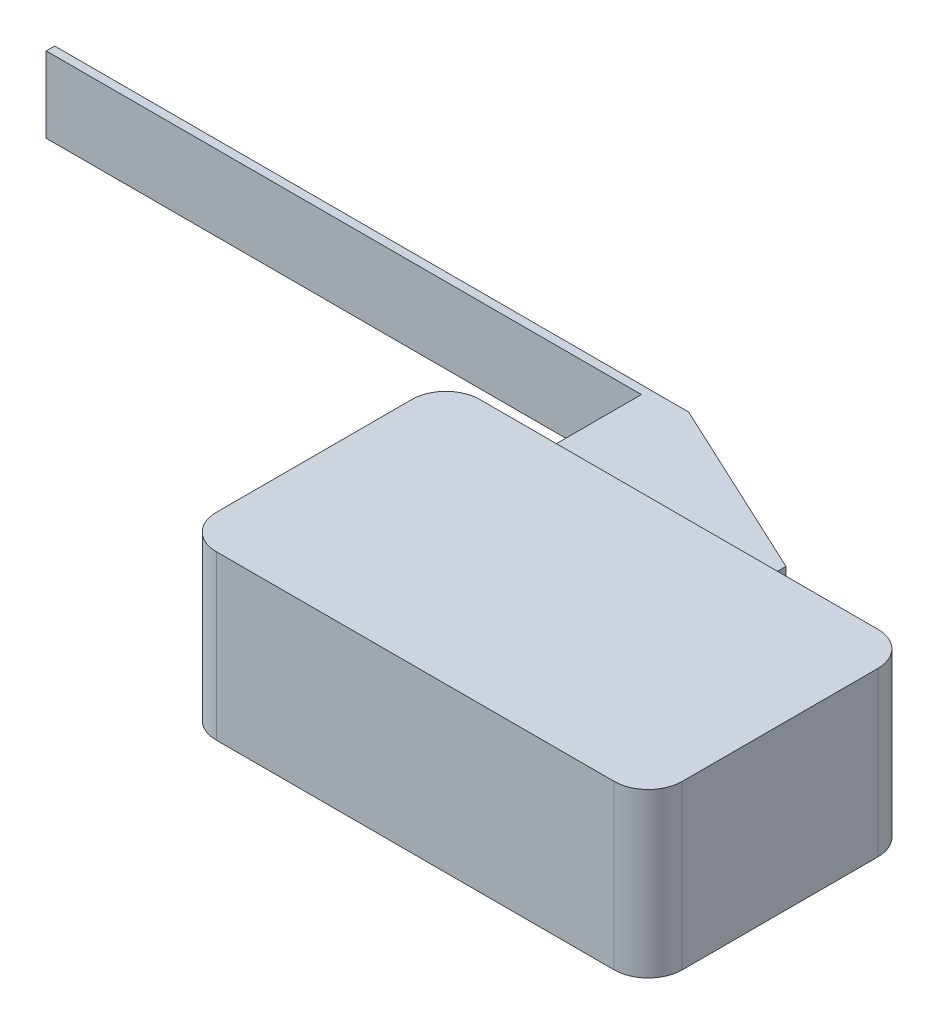
ISO-10303-21;
HEADER;
FILE_DESCRIPTION(('STEP AP214'),'2;1');
FILE_NAME('part.step','',(''),(''),'','','');
FILE_SCHEMA(('AUTOMOTIVE_DESIGN { 1 0 10303 214 1 1 1 1 }'));
ENDSEC;
DATA;
#1=APPLICATION_CONTEXT('core data for automotive mechanical design processes');
#2=APPLICATION_PROTOCOL_DEFINITION('international standard','automotive_design',2000,#1);
#3=PRODUCT_CONTEXT('',#1,'mechanical');
#4=PRODUCT('Part','Part','',(#3));
#5=PRODUCT_RELATED_PRODUCT_CATEGORY('part','',(#4));
#6=PRODUCT_DEFINITION_FORMATION('','',#4);
#7=PRODUCT_DEFINITION_CONTEXT('part definition',#1,'design');
#8=PRODUCT_DEFINITION('design','',#6,#7);
#9=PRODUCT_DEFINITION_SHAPE('','',#8);
#10=(LENGTH_UNIT() NAMED_UNIT(*) SI_UNIT(.MILLI.,.METRE.));
#11=(NAMED_UNIT(*) PLANE_ANGLE_UNIT() SI_UNIT($,.RADIAN.));
#12=(NAMED_UNIT(*) SI_UNIT($,.STERADIAN.) SOLID_ANGLE_UNIT());
#13=UNCERTAINTY_MEASURE_WITH_UNIT(LENGTH_MEASURE(1.E-05),#10,'distance_accuracy_value','');
#14=(GEOMETRIC_REPRESENTATION_CONTEXT(3) GLOBAL_UNCERTAINTY_ASSIGNED_CONTEXT((#13)) GLOBAL_UNIT_ASSIGNED_CONTEXT((#10,
#11,#12)) REPRESENTATION_CONTEXT('',''));
#15=CARTESIAN_POINT('',(0.,0.,0.));
#16=DIRECTION('',(0.,0.,1.));
#17=DIRECTION('',(1.,0.,0.));
#18=AXIS2_PLACEMENT_3D('',#15,#16,#17);
#19=CARTESIAN_POINT('',(4.,2.65,-23.5));
#20=DIRECTION('',(1.,0.,0.));
#21=DIRECTION('',(0.,0.,-1.));
#22=AXIS2_PLACEMENT_3D('',#19,#20,#21);
#23=PLANE('',#22);
#24=DIRECTION('',(0.,1.,0.));
#25=VECTOR('',#24,1.);
#26=CARTESIAN_POINT('',(4.,2.65,-23.));
#27=LINE('',#26,#25);
#28=CARTESIAN_POINT('',(4.,2.65,-23.));
#29=VERTEX_POINT('',#28);
#30=CARTESIAN_POINT('',(4.,7.1,-23.));
#31=VERTEX_POINT('',#30);
#32=EDGE_CURVE('E167',#29,#31,#27,.T.);
#33=ORIENTED_EDGE('',*,*,#32,.F.);
#34=DIRECTION('',(0.,0.,1.));
#35=VECTOR('',#34,1.);
#36=CARTESIAN_POINT('',(4.,2.65,-23.5));
#37=LINE('',#36,#35);
#38=CARTESIAN_POINT('',(4.,2.65,-15.5));
#39=VERTEX_POINT('',#38);
#40=EDGE_CURVE('E151',#29,#39,#37,.T.);
#41=ORIENTED_EDGE('',*,*,#40,.T.);
#42=DIRECTION('',(0.,1.,0.));
#43=VECTOR('',#42,1.);
#44=CARTESIAN_POINT('',(4.,2.65,-15.5));
#45=LINE('',#44,#43);
#46=CARTESIAN_POINT('',(4.,7.1,-15.5));
#47=VERTEX_POINT('',#46);
#48=EDGE_CURVE('E177',#39,#47,#45,.T.);
#49=ORIENTED_EDGE('',*,*,#48,.T.);
#50=DIRECTION('',(0.,0.,1.));
#51=VECTOR('',#50,1.);
#52=CARTESIAN_POINT('',(4.,7.1,-23.5));
#53=LINE('',#52,#51);
#54=EDGE_CURVE('E195',#31,#47,#53,.T.);
#55=ORIENTED_EDGE('',*,*,#54,.F.);
#56=EDGE_LOOP('',(#33,#41,#49,#55));
#57=FACE_BOUND('',#56,.T.);
#58=ADVANCED_FACE('F38',(#57),#23,.F.);
#59=CARTESIAN_POINT('',(0.,9.6,-15.5));
#60=DIRECTION('',(0.,0.,1.));
#61=DIRECTION('',(1.,0.,0.));
#62=AXIS2_PLACEMENT_3D('',#59,#60,#61);
#63=PLANE('',#62);
#64=DIRECTION('',(-1.,0.,0.));
#65=VECTOR('',#64,1.);
#66=CARTESIAN_POINT('',(0.,0.,-15.5));
#67=LINE('',#66,#65);
#68=CARTESIAN_POINT('',(25.4,0.,-15.5));
#69=VERTEX_POINT('',#68);
#70=CARTESIAN_POINT('',(2.,0.,-15.5));
#71=VERTEX_POINT('',#70);
#72=EDGE_CURVE('E202',#69,#71,#67,.T.);
#73=ORIENTED_EDGE('',*,*,#72,.T.);
#74=DIRECTION('',(0.,-1.,0.));
#75=VECTOR('',#74,1.);
#76=CARTESIAN_POINT('',(2.,9.6,-15.5));
#77=LINE('',#76,#75);
#78=CARTESIAN_POINT('',(2.,9.6,-15.5));
#79=VERTEX_POINT('',#78);
#80=EDGE_CURVE('E237',#71,#79,#77,.F.);
#81=ORIENTED_EDGE('',*,*,#80,.T.);
#82=DIRECTION('',(-1.,0.,0.));
#83=VECTOR('',#82,1.);
#84=CARTESIAN_POINT('',(0.,9.6,-15.5));
#85=LINE('',#84,#83);
#86=CARTESIAN_POINT('',(25.4,9.6,-15.5));
#87=VERTEX_POINT('',#86);
#88=EDGE_CURVE('E208',#87,#79,#85,.T.);
#89=ORIENTED_EDGE('',*,*,#88,.F.);
#90=DIRECTION('',(0.,-1.,0.));
#91=VECTOR('',#90,1.);
#92=CARTESIAN_POINT('',(25.4,9.6,-15.5));
#93=LINE('',#92,#91);
#94=EDGE_CURVE('E234',#87,#69,#93,.T.);
#95=ORIENTED_EDGE('',*,*,#94,.T.);
#96=EDGE_LOOP('',(#73,#81,#89,#95));
#97=FACE_BOUND('',#96,.T.);
#98=ORIENTED_EDGE('',*,*,#48,.F.);
#99=DIRECTION('',(-1.,0.,0.));
#100=VECTOR('',#99,1.);
#101=CARTESIAN_POINT('',(4.,2.65,-15.5));
#102=LINE('',#101,#100);
#103=CARTESIAN_POINT('',(17.,2.65,-15.5));
#104=VERTEX_POINT('',#103);
#105=EDGE_CURVE('E178',#104,#39,#102,.T.);
#106=ORIENTED_EDGE('',*,*,#105,.F.);
#107=DIRECTION('',(0.,-1.,0.));
#108=VECTOR('',#107,1.);
#109=CARTESIAN_POINT('',(17.,2.65,-15.5));
#110=LINE('',#109,#108);
#111=CARTESIAN_POINT('',(17.,7.1,-15.5));
#112=VERTEX_POINT('',#111);
#113=EDGE_CURVE('E185',#112,#104,#110,.T.);
#114=ORIENTED_EDGE('',*,*,#113,.F.);
#115=DIRECTION('',(1.,0.,0.));
#116=VECTOR('',#115,1.);
#117=CARTESIAN_POINT('',(4.,7.1,-15.5));
#118=LINE('',#117,#116);
#119=EDGE_CURVE('E182',#47,#112,#118,.T.);
#120=ORIENTED_EDGE('',*,*,#119,.F.);
#121=EDGE_LOOP('',(#98,#106,#114,#120));
#122=FACE_BOUND('',#121,.T.);
#123=ADVANCED_FACE('F287',(#97,#122),#63,.F.);
#124=CARTESIAN_POINT('',(0.,9.6,0.));
#125=DIRECTION('',(1.,0.,0.));
#126=DIRECTION('',(0.,0.,-1.));
#127=AXIS2_PLACEMENT_3D('',#124,#125,#126);
#128=PLANE('',#127);
#129=DIRECTION('',(0.,0.,1.));
#130=VECTOR('',#129,1.);
#131=CARTESIAN_POINT('',(0.,9.6,0.));
#132=LINE('',#131,#130);
#133=CARTESIAN_POINT('',(0.,9.6,-13.5));
#134=VERTEX_POINT('',#133);
#135=CARTESIAN_POINT('',(0.,9.6,-2.));
#136=VERTEX_POINT('',#135);
#137=EDGE_CURVE('E198',#134,#136,#132,.T.);
#138=ORIENTED_EDGE('',*,*,#137,.F.);
#139=DIRECTION('',(0.,-1.,0.));
#140=VECTOR('',#139,1.);
#141=CARTESIAN_POINT('',(0.,9.6,-13.5));
#142=LINE('',#141,#140);
#143=CARTESIAN_POINT('',(0.,0.,-13.5));
#144=VERTEX_POINT('',#143);
#145=EDGE_CURVE('E223',#134,#144,#142,.T.);
#146=ORIENTED_EDGE('',*,*,#145,.T.);
#147=DIRECTION('',(0.,0.,1.));
#148=VECTOR('',#147,1.);
#149=CARTESIAN_POINT('',(0.,0.,0.));
#150=LINE('',#149,#148);
#151=CARTESIAN_POINT('',(0.,0.,-2.));
#152=VERTEX_POINT('',#151);
#153=EDGE_CURVE('E197',#144,#152,#150,.T.);
#154=ORIENTED_EDGE('',*,*,#153,.T.);
#155=DIRECTION('',(0.,-1.,0.));
#156=VECTOR('',#155,1.);
#157=CARTESIAN_POINT('',(0.,9.6,-2.));
#158=LINE('',#157,#156);
#159=EDGE_CURVE('E211',#152,#136,#158,.F.);
#160=ORIENTED_EDGE('',*,*,#159,.T.);
#161=EDGE_LOOP('',(#138,#146,#154,#160));
#162=FACE_BOUND('',#161,.T.);
#163=ADVANCED_FACE('F296',(#162),#128,.F.);
#164=CARTESIAN_POINT('',(0.,9.6,0.));
#165=DIRECTION('',(0.,0.,-1.));
#166=DIRECTION('',(-1.,0.,0.));
#167=AXIS2_PLACEMENT_3D('',#164,#165,#166);
#168=PLANE('',#167);
#169=DIRECTION('',(1.,0.,0.));
#170=VECTOR('',#169,1.);
#171=CARTESIAN_POINT('',(0.,9.6,0.));
#172=LINE('',#171,#170);
#173=CARTESIAN_POINT('',(2.,9.6,0.));
#174=VERTEX_POINT('',#173);
#175=CARTESIAN_POINT('',(25.4,9.6,0.));
#176=VERTEX_POINT('',#175);
#177=EDGE_CURVE('E201',#174,#176,#172,.T.);
#178=ORIENTED_EDGE('',*,*,#177,.F.);
#179=DIRECTION('',(0.,-1.,0.));
#180=VECTOR('',#179,1.);
#181=CARTESIAN_POINT('',(2.,9.6,0.));
#182=LINE('',#181,#180);
#183=CARTESIAN_POINT('',(2.,0.,0.));
#184=VERTEX_POINT('',#183);
#185=EDGE_CURVE('E254',#174,#184,#182,.T.);
#186=ORIENTED_EDGE('',*,*,#185,.T.);
#187=DIRECTION('',(1.,0.,0.));
#188=VECTOR('',#187,1.);
#189=CARTESIAN_POINT('',(0.,0.,0.));
#190=LINE('',#189,#188);
#191=CARTESIAN_POINT('',(25.4,0.,0.));
#192=VERTEX_POINT('',#191);
#193=EDGE_CURVE('E214',#184,#192,#190,.T.);
#194=ORIENTED_EDGE('',*,*,#193,.T.);
#195=DIRECTION('',(0.,-1.,0.));
#196=VECTOR('',#195,1.);
#197=CARTESIAN_POINT('',(25.4,9.6,0.));
#198=LINE('',#197,#196);
#199=EDGE_CURVE('E252',#192,#176,#198,.F.);
#200=ORIENTED_EDGE('',*,*,#199,.T.);
#201=EDGE_LOOP('',(#178,#186,#194,#200));
#202=FACE_BOUND('',#201,.T.);
#203=ADVANCED_FACE('F262',(#202),#168,.F.);
#204=CARTESIAN_POINT('',(27.4,9.6,0.));
#205=DIRECTION('',(-1.,0.,0.));
#206=DIRECTION('',(0.,0.,1.));
#207=AXIS2_PLACEMENT_3D('',#204,#205,#206);
#208=PLANE('',#207);
#209=DIRECTION('',(0.,0.,-1.));
#210=VECTOR('',#209,1.);
#211=CARTESIAN_POINT('',(27.4,0.,0.));
#212=LINE('',#211,#210);
#213=CARTESIAN_POINT('',(27.4,0.,-2.));
#214=VERTEX_POINT('',#213);
#215=CARTESIAN_POINT('',(27.4,0.,-13.5));
#216=VERTEX_POINT('',#215);
#217=EDGE_CURVE('E217',#214,#216,#212,.T.);
#218=ORIENTED_EDGE('',*,*,#217,.T.);
#219=DIRECTION('',(0.,-1.,0.));
#220=VECTOR('',#219,1.);
#221=CARTESIAN_POINT('',(27.4,9.6,-13.5));
#222=LINE('',#221,#220);
#223=CARTESIAN_POINT('',(27.4,9.6,-13.5));
#224=VERTEX_POINT('',#223);
#225=EDGE_CURVE('E250',#216,#224,#222,.F.);
#226=ORIENTED_EDGE('',*,*,#225,.T.);
#227=DIRECTION('',(0.,0.,-1.));
#228=VECTOR('',#227,1.);
#229=CARTESIAN_POINT('',(27.4,9.6,0.));
#230=LINE('',#229,#228);
#231=CARTESIAN_POINT('',(27.4,9.6,-2.));
#232=VERTEX_POINT('',#231);
#233=EDGE_CURVE('E205',#232,#224,#230,.T.);
#234=ORIENTED_EDGE('',*,*,#233,.F.);
#235=DIRECTION('',(0.,-1.,0.));
#236=VECTOR('',#235,1.);
#237=CARTESIAN_POINT('',(27.4,9.6,-2.));
#238=LINE('',#237,#236);
#239=EDGE_CURVE('E247',#232,#214,#238,.T.);
#240=ORIENTED_EDGE('',*,*,#239,.T.);
#241=EDGE_LOOP('',(#218,#226,#234,#240));
#242=FACE_BOUND('',#241,.T.);
#243=ADVANCED_FACE('F276',(#242),#208,.F.);
#244=CARTESIAN_POINT('',(0.,9.6,0.));
#245=DIRECTION('',(0.,-1.,0.));
#246=DIRECTION('',(0.,0.,-1.));
#247=AXIS2_PLACEMENT_3D('',#244,#245,#246);
#248=PLANE('',#247);
#249=ORIENTED_EDGE('',*,*,#88,.T.);
#250=CARTESIAN_POINT('',(2.,9.6,-13.5));
#251=DIRECTION('',(0.,-1.,0.));
#252=DIRECTION('',(0.,0.,-1.));
#253=AXIS2_PLACEMENT_3D('',#250,#251,#252);
#254=CIRCLE('',#253,2.);
#255=EDGE_CURVE('E245',#79,#134,#254,.F.);
#256=ORIENTED_EDGE('',*,*,#255,.T.);
#257=ORIENTED_EDGE('',*,*,#137,.T.);
#258=CARTESIAN_POINT('',(2.,9.6,-2.));
#259=DIRECTION('',(0.,-1.,0.));
#260=DIRECTION('',(0.,0.,-1.));
#261=AXIS2_PLACEMENT_3D('',#258,#259,#260);
#262=CIRCLE('',#261,2.);
#263=EDGE_CURVE('E241',#136,#174,#262,.F.);
#264=ORIENTED_EDGE('',*,*,#263,.T.);
#265=ORIENTED_EDGE('',*,*,#177,.T.);
#266=CARTESIAN_POINT('',(25.4,9.6,-2.));
#267=DIRECTION('',(0.,-1.,0.));
#268=DIRECTION('',(0.,0.,-1.));
#269=AXIS2_PLACEMENT_3D('',#266,#267,#268);
#270=CIRCLE('',#269,2.);
#271=EDGE_CURVE('E239',#176,#232,#270,.F.);
#272=ORIENTED_EDGE('',*,*,#271,.T.);
#273=ORIENTED_EDGE('',*,*,#233,.T.);
#274=CARTESIAN_POINT('',(25.4,9.6,-13.5));
#275=DIRECTION('',(0.,-1.,0.));
#276=DIRECTION('',(0.,0.,-1.));
#277=AXIS2_PLACEMENT_3D('',#274,#275,#276);
#278=CIRCLE('',#277,2.);
#279=EDGE_CURVE('E243',#224,#87,#278,.F.);
#280=ORIENTED_EDGE('',*,*,#279,.T.);
#281=EDGE_LOOP('',(#249,#256,#257,#264,#265,#272,#273,#280));
#282=FACE_BOUND('',#281,.T.);
#283=ADVANCED_FACE('F280',(#282),#248,.F.);
#284=CARTESIAN_POINT('',(0.,0.,0.));
#285=DIRECTION('',(0.,-1.,0.));
#286=DIRECTION('',(0.,0.,-1.));
#287=AXIS2_PLACEMENT_3D('',#284,#285,#286);
#288=PLANE('',#287);
#289=ORIENTED_EDGE('',*,*,#153,.F.);
#290=CARTESIAN_POINT('',(2.,0.,-13.5));
#291=DIRECTION('',(0.,-1.,0.));
#292=DIRECTION('',(0.,0.,-1.));
#293=AXIS2_PLACEMENT_3D('',#290,#291,#292);
#294=CIRCLE('',#293,2.);
#295=EDGE_CURVE('E232',#144,#71,#294,.T.);
#296=ORIENTED_EDGE('',*,*,#295,.T.);
#297=ORIENTED_EDGE('',*,*,#72,.F.);
#298=CARTESIAN_POINT('',(25.4,0.,-13.5));
#299=DIRECTION('',(0.,-1.,0.));
#300=DIRECTION('',(0.,0.,-1.));
#301=AXIS2_PLACEMENT_3D('',#298,#299,#300);
#302=CIRCLE('',#301,2.);
#303=EDGE_CURVE('E230',#69,#216,#302,.T.);
#304=ORIENTED_EDGE('',*,*,#303,.T.);
#305=ORIENTED_EDGE('',*,*,#217,.F.);
#306=CARTESIAN_POINT('',(25.4,0.,-2.));
#307=DIRECTION('',(0.,-1.,0.));
#308=DIRECTION('',(0.,0.,-1.));
#309=AXIS2_PLACEMENT_3D('',#306,#307,#308);
#310=CIRCLE('',#309,2.);
#311=EDGE_CURVE('E226',#214,#192,#310,.T.);
#312=ORIENTED_EDGE('',*,*,#311,.T.);
#313=ORIENTED_EDGE('',*,*,#193,.F.);
#314=CARTESIAN_POINT('',(2.,0.,-2.));
#315=DIRECTION('',(0.,-1.,0.));
#316=DIRECTION('',(0.,0.,-1.));
#317=AXIS2_PLACEMENT_3D('',#314,#315,#316);
#318=CIRCLE('',#317,2.);
#319=EDGE_CURVE('E228',#184,#152,#318,.T.);
#320=ORIENTED_EDGE('',*,*,#319,.T.);
#321=EDGE_LOOP('',(#289,#296,#297,#304,#305,#312,#313,#320));
#322=FACE_BOUND('',#321,.T.);
#323=ADVANCED_FACE('F268',(#322),#288,.T.);
#324=CARTESIAN_POINT('',(2.,9.6,-13.5));
#325=DIRECTION('',(0.,-1.,0.));
#326=DIRECTION('',(0.,0.,-1.));
#327=AXIS2_PLACEMENT_3D('',#324,#325,#326);
#328=CYLINDRICAL_SURFACE('',#327,2.);
#329=ORIENTED_EDGE('',*,*,#255,.F.);
#330=ORIENTED_EDGE('',*,*,#80,.F.);
#331=ORIENTED_EDGE('',*,*,#295,.F.);
#332=ORIENTED_EDGE('',*,*,#145,.F.);
#333=EDGE_LOOP('',(#329,#330,#331,#332));
#334=FACE_BOUND('',#333,.T.);
#335=ADVANCED_FACE('F293',(#334),#328,.T.);
#336=CARTESIAN_POINT('',(25.4,9.6,-13.5));
#337=DIRECTION('',(0.,-1.,0.));
#338=DIRECTION('',(0.,0.,-1.));
#339=AXIS2_PLACEMENT_3D('',#336,#337,#338);
#340=CYLINDRICAL_SURFACE('',#339,2.);
#341=ORIENTED_EDGE('',*,*,#279,.F.);
#342=ORIENTED_EDGE('',*,*,#225,.F.);
#343=ORIENTED_EDGE('',*,*,#303,.F.);
#344=ORIENTED_EDGE('',*,*,#94,.F.);
#345=EDGE_LOOP('',(#341,#342,#343,#344));
#346=FACE_BOUND('',#345,.T.);
#347=ADVANCED_FACE('F284',(#346),#340,.T.);
#348=CARTESIAN_POINT('',(2.,9.6,-2.));
#349=DIRECTION('',(0.,-1.,0.));
#350=DIRECTION('',(0.,0.,-1.));
#351=AXIS2_PLACEMENT_3D('',#348,#349,#350);
#352=CYLINDRICAL_SURFACE('',#351,2.);
#353=ORIENTED_EDGE('',*,*,#263,.F.);
#354=ORIENTED_EDGE('',*,*,#159,.F.);
#355=ORIENTED_EDGE('',*,*,#319,.F.);
#356=ORIENTED_EDGE('',*,*,#185,.F.);
#357=EDGE_LOOP('',(#353,#354,#355,#356));
#358=FACE_BOUND('',#357,.T.);
#359=ADVANCED_FACE('F298',(#358),#352,.T.);
#360=CARTESIAN_POINT('',(25.4,9.6,-2.));
#361=DIRECTION('',(0.,-1.,0.));
#362=DIRECTION('',(0.,0.,-1.));
#363=AXIS2_PLACEMENT_3D('',#360,#361,#362);
#364=CYLINDRICAL_SURFACE('',#363,2.);
#365=ORIENTED_EDGE('',*,*,#271,.F.);
#366=ORIENTED_EDGE('',*,*,#199,.F.);
#367=ORIENTED_EDGE('',*,*,#311,.F.);
#368=ORIENTED_EDGE('',*,*,#239,.F.);
#369=EDGE_LOOP('',(#365,#366,#367,#368));
#370=FACE_BOUND('',#369,.T.);
#371=ADVANCED_FACE('F273',(#370),#364,.T.);
#372=CARTESIAN_POINT('',(4.,7.1,-23.5));
#373=DIRECTION('',(0.,-1.,0.));
#374=DIRECTION('',(1.,0.,0.));
#375=AXIS2_PLACEMENT_3D('',#372,#373,#374);
#376=PLANE('',#375);
#377=DIRECTION('',(0.,0.,1.));
#378=VECTOR('',#377,1.);
#379=CARTESIAN_POINT('',(17.,7.1,-23.5));
#380=LINE('',#379,#378);
#381=CARTESIAN_POINT('',(17.,7.1,-18.5));
#382=VERTEX_POINT('',#381);
#383=EDGE_CURVE('E193',#382,#112,#380,.T.);
#384=ORIENTED_EDGE('',*,*,#383,.F.);
#385=DIRECTION('',(-0.906307787036649,0.,-0.422618261740701));
#386=VECTOR('',#385,1.);
#387=CARTESIAN_POINT('',(6.27746539745221,7.1,-23.5));
#388=LINE('',#387,#386);
#389=CARTESIAN_POINT('',(6.27746539745221,7.1,-23.5));
#390=VERTEX_POINT('',#389);
#391=EDGE_CURVE('E11',#382,#390,#388,.T.);
#392=ORIENTED_EDGE('',*,*,#391,.T.);
#393=DIRECTION('',(1.,0.,0.));
#394=VECTOR('',#393,1.);
#395=CARTESIAN_POINT('',(4.,7.1,-23.5));
#396=LINE('',#395,#394);
#397=CARTESIAN_POINT('',(-31.,7.1,-23.5));
#398=VERTEX_POINT('',#397);
#399=EDGE_CURVE('E152',#398,#390,#396,.T.);
#400=ORIENTED_EDGE('',*,*,#399,.F.);
#401=DIRECTION('',(0.,0.,-1.));
#402=VECTOR('',#401,1.);
#403=CARTESIAN_POINT('',(-31.,7.1,-23.5));
#404=LINE('',#403,#402);
#405=CARTESIAN_POINT('',(-31.,7.1,-23.));
#406=VERTEX_POINT('',#405);
#407=EDGE_CURVE('E166',#406,#398,#404,.T.);
#408=ORIENTED_EDGE('',*,*,#407,.F.);
#409=DIRECTION('',(1.,0.,0.));
#410=VECTOR('',#409,1.);
#411=CARTESIAN_POINT('',(-31.,7.1,-23.));
#412=LINE('',#411,#410);
#413=EDGE_CURVE('E172',#406,#31,#412,.T.);
#414=ORIENTED_EDGE('',*,*,#413,.T.);
#415=ORIENTED_EDGE('',*,*,#54,.T.);
#416=ORIENTED_EDGE('',*,*,#119,.T.);
#417=EDGE_LOOP('',(#384,#392,#400,#408,#414,#415,#416));
#418=FACE_BOUND('',#417,.T.);
#419=ADVANCED_FACE('F305',(#418),#376,.F.);
#420=CARTESIAN_POINT('',(17.,2.65,-23.5));
#421=DIRECTION('',(-1.,0.,0.));
#422=DIRECTION('',(0.,0.,1.));
#423=AXIS2_PLACEMENT_3D('',#420,#421,#422);
#424=PLANE('',#423);
#425=DIRECTION('',(0.,0.,1.));
#426=VECTOR('',#425,1.);
#427=CARTESIAN_POINT('',(17.,2.65,-23.5));
#428=LINE('',#427,#426);
#429=CARTESIAN_POINT('',(17.,2.65,-18.5));
#430=VERTEX_POINT('',#429);
#431=EDGE_CURVE('E191',#430,#104,#428,.T.);
#432=ORIENTED_EDGE('',*,*,#431,.F.);
#433=DIRECTION('',(0.,1.,0.));
#434=VECTOR('',#433,1.);
#435=CARTESIAN_POINT('',(17.,7.1,-18.5));
#436=LINE('',#435,#434);
#437=EDGE_CURVE('E46',#430,#382,#436,.T.);
#438=ORIENTED_EDGE('',*,*,#437,.T.);
#439=ORIENTED_EDGE('',*,*,#383,.T.);
#440=ORIENTED_EDGE('',*,*,#113,.T.);
#441=EDGE_LOOP('',(#432,#438,#439,#440));
#442=FACE_BOUND('',#441,.T.);
#443=ADVANCED_FACE('F390',(#442),#424,.F.);
#444=CARTESIAN_POINT('',(4.,2.65,-23.5));
#445=DIRECTION('',(0.,1.,0.));
#446=DIRECTION('',(-1.,0.,0.));
#447=AXIS2_PLACEMENT_3D('',#444,#445,#446);
#448=PLANE('',#447);
#449=DIRECTION('',(-1.,0.,0.));
#450=VECTOR('',#449,1.);
#451=CARTESIAN_POINT('',(4.,2.65,-23.5));
#452=LINE('',#451,#450);
#453=CARTESIAN_POINT('',(6.27746539745221,2.65,-23.5));
#454=VERTEX_POINT('',#453);
#455=CARTESIAN_POINT('',(-31.,2.65,-23.5));
#456=VERTEX_POINT('',#455);
#457=EDGE_CURVE('E143',#454,#456,#452,.T.);
#458=ORIENTED_EDGE('',*,*,#457,.F.);
#459=DIRECTION('',(0.906307787036649,0.,0.422618261740701));
#460=VECTOR('',#459,1.);
#461=CARTESIAN_POINT('',(6.27746539745221,2.65,-23.5));
#462=LINE('',#461,#460);
#463=EDGE_CURVE('E60',#454,#430,#462,.T.);
#464=ORIENTED_EDGE('',*,*,#463,.T.);
#465=ORIENTED_EDGE('',*,*,#431,.T.);
#466=ORIENTED_EDGE('',*,*,#105,.T.);
#467=ORIENTED_EDGE('',*,*,#40,.F.);
#468=DIRECTION('',(1.,0.,0.));
#469=VECTOR('',#468,1.);
#470=CARTESIAN_POINT('',(-31.,2.65,-23.));
#471=LINE('',#470,#469);
#472=CARTESIAN_POINT('',(-31.,2.65,-23.));
#473=VERTEX_POINT('',#472);
#474=EDGE_CURVE('E158',#473,#29,#471,.T.);
#475=ORIENTED_EDGE('',*,*,#474,.F.);
#476=DIRECTION('',(0.,0.,1.));
#477=VECTOR('',#476,1.);
#478=CARTESIAN_POINT('',(-31.,2.65,-23.5));
#479=LINE('',#478,#477);
#480=EDGE_CURVE('E155',#456,#473,#479,.T.);
#481=ORIENTED_EDGE('',*,*,#480,.F.);
#482=EDGE_LOOP('',(#458,#464,#465,#466,#467,#475,#481));
#483=FACE_BOUND('',#482,.T.);
#484=ADVANCED_FACE('F156',(#483),#448,.F.);
#485=CARTESIAN_POINT('',(0.,0.,-23.5));
#486=DIRECTION('',(0.,0.,-1.));
#487=DIRECTION('',(-1.,0.,0.));
#488=AXIS2_PLACEMENT_3D('',#485,#486,#487);
#489=PLANE('',#488);
#490=ORIENTED_EDGE('',*,*,#399,.T.);
#491=DIRECTION('',(0.,-1.,0.));
#492=VECTOR('',#491,1.);
#493=CARTESIAN_POINT('',(6.27746539745221,2.65,-23.5));
#494=LINE('',#493,#492);
#495=EDGE_CURVE('E150',#390,#454,#494,.T.);
#496=ORIENTED_EDGE('',*,*,#495,.T.);
#497=ORIENTED_EDGE('',*,*,#457,.T.);
#498=DIRECTION('',(0.,-1.,0.));
#499=VECTOR('',#498,1.);
#500=CARTESIAN_POINT('',(-31.,2.65,-23.5));
#501=LINE('',#500,#499);
#502=EDGE_CURVE('E148',#398,#456,#501,.T.);
#503=ORIENTED_EDGE('',*,*,#502,.F.);
#504=EDGE_LOOP('',(#490,#496,#497,#503));
#505=FACE_BOUND('',#504,.T.);
#506=ADVANCED_FACE('F146',(#505),#489,.T.);
#507=CARTESIAN_POINT('',(-31.,2.65,-23.));
#508=DIRECTION('',(0.,0.,-1.));
#509=DIRECTION('',(-1.,0.,0.));
#510=AXIS2_PLACEMENT_3D('',#507,#508,#509);
#511=PLANE('',#510);
#512=ORIENTED_EDGE('',*,*,#32,.T.);
#513=ORIENTED_EDGE('',*,*,#413,.F.);
#514=DIRECTION('',(0.,1.,0.));
#515=VECTOR('',#514,1.);
#516=CARTESIAN_POINT('',(-31.,2.65,-23.));
#517=LINE('',#516,#515);
#518=EDGE_CURVE('E161',#473,#406,#517,.T.);
#519=ORIENTED_EDGE('',*,*,#518,.F.);
#520=ORIENTED_EDGE('',*,*,#474,.T.);
#521=EDGE_LOOP('',(#512,#513,#519,#520));
#522=FACE_BOUND('',#521,.T.);
#523=ADVANCED_FACE('F366',(#522),#511,.F.);
#524=CARTESIAN_POINT('',(-31.,0.,0.));
#525=DIRECTION('',(1.,0.,0.));
#526=DIRECTION('',(0.,0.,-1.));
#527=AXIS2_PLACEMENT_3D('',#524,#525,#526);
#528=PLANE('',#527);
#529=ORIENTED_EDGE('',*,*,#502,.T.);
#530=ORIENTED_EDGE('',*,*,#480,.T.);
#531=ORIENTED_EDGE('',*,*,#518,.T.);
#532=ORIENTED_EDGE('',*,*,#407,.T.);
#533=EDGE_LOOP('',(#529,#530,#531,#532));
#534=FACE_BOUND('',#533,.T.);
#535=ADVANCED_FACE('F164',(#534),#528,.F.);
#536=CARTESIAN_POINT('',(6.27746539745221,0.,-23.5));
#537=DIRECTION('',(0.422618261740701,0.,-0.906307787036649));
#538=DIRECTION('',(0.,1.,0.));
#539=AXIS2_PLACEMENT_3D('',#536,#537,#538);
#540=PLANE('',#539);
#541=ORIENTED_EDGE('',*,*,#391,.F.);
#542=ORIENTED_EDGE('',*,*,#437,.F.);
#543=ORIENTED_EDGE('',*,*,#463,.F.);
#544=ORIENTED_EDGE('',*,*,#495,.F.);
#545=EDGE_LOOP('',(#541,#542,#543,#544));
#546=FACE_BOUND('',#545,.T.);
#547=ADVANCED_FACE('F40',(#546),#540,.T.);
#548=CLOSED_SHELL('',(#58,#123,#163,#203,#243,#283,#323,#335,#347,#359,#371,#419,#443,#484,#506,
#523,#535,#547));
#549=MANIFOLD_SOLID_BREP('B2',#548);
#550=ADVANCED_BREP_SHAPE_REPRESENTATION('',(#18,#549),#14);
#551=SHAPE_DEFINITION_REPRESENTATION(#9,#550);
ENDSEC;
END-ISO-10303-21;
